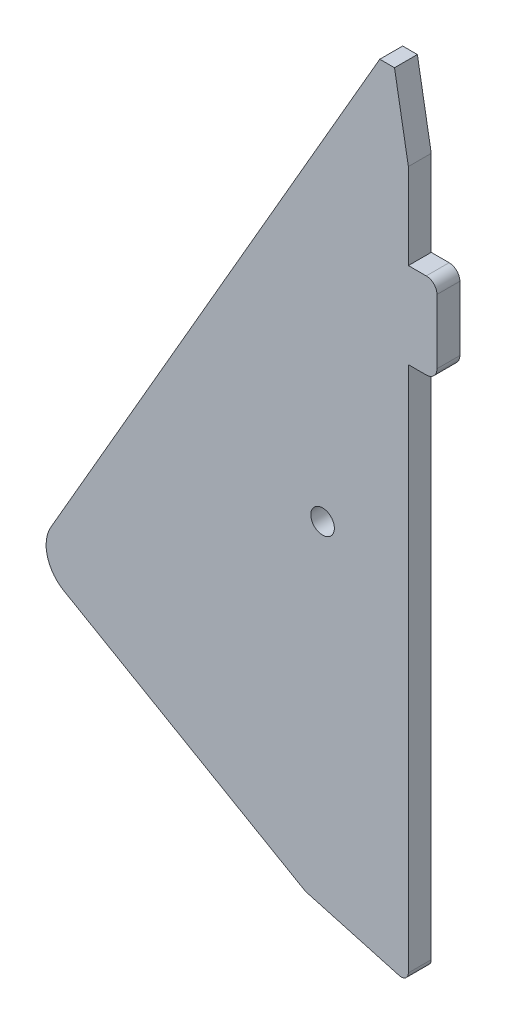
ISO-10303-21;
HEADER;
FILE_DESCRIPTION(('STEP AP214'),'2;1');
FILE_NAME('part.step','',(''),(''),'','','');
FILE_SCHEMA(('AUTOMOTIVE_DESIGN { 1 0 10303 214 1 1 1 1 }'));
ENDSEC;
DATA;
#1=APPLICATION_CONTEXT('core data for automotive mechanical design processes');
#2=APPLICATION_PROTOCOL_DEFINITION('international standard','automotive_design',2000,#1);
#3=PRODUCT_CONTEXT('',#1,'mechanical');
#4=PRODUCT('Part','Part','',(#3));
#5=PRODUCT_RELATED_PRODUCT_CATEGORY('part','',(#4));
#6=PRODUCT_DEFINITION_FORMATION('','',#4);
#7=PRODUCT_DEFINITION_CONTEXT('part definition',#1,'design');
#8=PRODUCT_DEFINITION('design','',#6,#7);
#9=PRODUCT_DEFINITION_SHAPE('','',#8);
#10=(LENGTH_UNIT() NAMED_UNIT(*) SI_UNIT(.MILLI.,.METRE.));
#11=(NAMED_UNIT(*) PLANE_ANGLE_UNIT() SI_UNIT($,.RADIAN.));
#12=(NAMED_UNIT(*) SI_UNIT($,.STERADIAN.) SOLID_ANGLE_UNIT());
#13=UNCERTAINTY_MEASURE_WITH_UNIT(LENGTH_MEASURE(1.E-05),#10,'distance_accuracy_value','');
#14=(GEOMETRIC_REPRESENTATION_CONTEXT(3) GLOBAL_UNCERTAINTY_ASSIGNED_CONTEXT((#13)) GLOBAL_UNIT_ASSIGNED_CONTEXT((#10,
#11,#12)) REPRESENTATION_CONTEXT('',''));
#15=CARTESIAN_POINT('',(0.,0.,0.));
#16=DIRECTION('',(0.,0.,1.));
#17=DIRECTION('',(1.,0.,0.));
#18=AXIS2_PLACEMENT_3D('',#15,#16,#17);
#19=CARTESIAN_POINT('',(49.9999999999627,44.0000000000083,3.2));
#20=DIRECTION('',(-1.,0.,0.));
#21=DIRECTION('',(0.,0.,1.));
#22=AXIS2_PLACEMENT_3D('',#19,#20,#21);
#23=PLANE('',#22);
#24=DIRECTION('',(0.,1.,0.));
#25=VECTOR('',#24,1.);
#26=CARTESIAN_POINT('',(49.9999999999627,44.0000000000083,3.2));
#27=LINE('',#26,#25);
#28=CARTESIAN_POINT('',(49.9999999999627,32.0000000000083,3.2));
#29=VERTEX_POINT('',#28);
#30=CARTESIAN_POINT('',(49.9999999999627,44.0000000000083,3.2));
#31=VERTEX_POINT('',#30);
#32=EDGE_CURVE('E187',#29,#31,#27,.T.);
#33=ORIENTED_EDGE('',*,*,#32,.F.);
#34=DIRECTION('',(0.,0.,1.));
#35=VECTOR('',#34,1.);
#36=CARTESIAN_POINT('',(49.9999999999627,32.0000000000083,-12.6491106406735));
#37=LINE('',#36,#35);
#38=CARTESIAN_POINT('',(49.9999999999627,32.0000000000083,0.));
#39=VERTEX_POINT('',#38);
#40=EDGE_CURVE('E186',#39,#29,#37,.T.);
#41=ORIENTED_EDGE('',*,*,#40,.F.);
#42=DIRECTION('',(0.,1.,0.));
#43=VECTOR('',#42,1.);
#44=CARTESIAN_POINT('',(49.9999999999627,44.0000000000083,0.));
#45=LINE('',#44,#43);
#46=CARTESIAN_POINT('',(49.9999999999627,44.0000000000083,0.));
#47=VERTEX_POINT('',#46);
#48=EDGE_CURVE('E169',#39,#47,#45,.T.);
#49=ORIENTED_EDGE('',*,*,#48,.T.);
#50=DIRECTION('',(0.,0.,-1.));
#51=VECTOR('',#50,1.);
#52=CARTESIAN_POINT('',(49.9999999999627,44.0000000000083,3.2));
#53=LINE('',#52,#51);
#54=EDGE_CURVE('E291',#31,#47,#53,.T.);
#55=ORIENTED_EDGE('',*,*,#54,.F.);
#56=EDGE_LOOP('',(#33,#41,#49,#55));
#57=FACE_BOUND('',#56,.T.);
#58=ADVANCED_FACE('F38',(#57),#23,.F.);
#59=CARTESIAN_POINT('',(48.9999999999626,-53.6846267095835,3.2));
#60=DIRECTION('',(0.,0.,1.));
#61=DIRECTION('',(1.,0.,0.));
#62=AXIS2_PLACEMENT_3D('',#59,#60,#61);
#63=PLANE('',#62);
#64=DIRECTION('',(0.,1.,0.));
#65=VECTOR('',#64,1.);
#66=CARTESIAN_POINT('',(53.9999999999626,32.0000000000083,3.2));
#67=LINE('',#66,#65);
#68=CARTESIAN_POINT('',(53.9999999999626,21.5000000000083,3.2));
#69=VERTEX_POINT('',#68);
#70=CARTESIAN_POINT('',(53.9999999999626,30.5000000000083,3.2));
#71=VERTEX_POINT('',#70);
#72=EDGE_CURVE('E208',#69,#71,#67,.T.);
#73=ORIENTED_EDGE('',*,*,#72,.T.);
#74=CARTESIAN_POINT('',(52.4999999999626,30.5000000000083,3.2));
#75=DIRECTION('',(0.,0.,1.));
#76=DIRECTION('',(1.,0.,0.));
#77=AXIS2_PLACEMENT_3D('',#74,#75,#76);
#78=CIRCLE('',#77,1.5);
#79=CARTESIAN_POINT('',(52.4999999999626,32.0000000000083,3.2));
#80=VERTEX_POINT('',#79);
#81=EDGE_CURVE('E312',#71,#80,#78,.T.);
#82=ORIENTED_EDGE('',*,*,#81,.T.);
#83=DIRECTION('',(-1.,0.,0.));
#84=VECTOR('',#83,1.);
#85=CARTESIAN_POINT('',(49.9999999999627,32.0000000000083,3.2));
#86=LINE('',#85,#84);
#87=EDGE_CURVE('E212',#80,#29,#86,.T.);
#88=ORIENTED_EDGE('',*,*,#87,.T.);
#89=ORIENTED_EDGE('',*,*,#32,.T.);
#90=DIRECTION('',(-0.173648177667528,0.984807753012103,0.));
#91=VECTOR('',#90,1.);
#92=CARTESIAN_POINT('',(49.9999999999627,44.0000000000083,3.2));
#93=LINE('',#92,#91);
#94=CARTESIAN_POINT('',(48.0604032121626,55.0000000000083,3.2));
#95=VERTEX_POINT('',#94);
#96=EDGE_CURVE('E237',#31,#95,#93,.T.);
#97=ORIENTED_EDGE('',*,*,#96,.T.);
#98=DIRECTION('',(-1.,0.,0.));
#99=VECTOR('',#98,1.);
#100=CARTESIAN_POINT('',(45.9999999999626,55.0000000000083,3.2));
#101=LINE('',#100,#99);
#102=CARTESIAN_POINT('',(45.9999999999626,55.0000000000083,3.2));
#103=VERTEX_POINT('',#102);
#104=EDGE_CURVE('E240',#95,#103,#101,.T.);
#105=ORIENTED_EDGE('',*,*,#104,.T.);
#106=DIRECTION('',(-0.5,-0.866025403784439,0.));
#107=VECTOR('',#106,1.);
#108=CARTESIAN_POINT('',(-4.52970386238235E-11,-24.6743371481738,3.2));
#109=LINE('',#108,#107);
#110=CARTESIAN_POINT('',(-4.52953646812304E-11,-24.6743371481738,3.2));
#111=VERTEX_POINT('',#110);
#112=EDGE_CURVE('E242',#103,#111,#109,.T.);
#113=ORIENTED_EDGE('',*,*,#112,.T.);
#114=CARTESIAN_POINT('',(4.33012701887688,-27.1743371481738,3.2));
#115=DIRECTION('',(0.,0.,1.));
#116=DIRECTION('',(1.,0.,0.));
#117=AXIS2_PLACEMENT_3D('',#114,#115,#116);
#118=CIRCLE('',#117,4.99999999999998);
#119=CARTESIAN_POINT('',(1.83012701886026,-31.5044641670864,3.2));
#120=VERTEX_POINT('',#119);
#121=EDGE_CURVE('E245',#111,#120,#118,.T.);
#122=ORIENTED_EDGE('',*,*,#121,.T.);
#123=DIRECTION('',(0.866025403784439,-0.5,0.));
#124=VECTOR('',#123,1.);
#125=CARTESIAN_POINT('',(1.83012701886026,-31.5044641670864,3.2));
#126=LINE('',#125,#124);
#127=CARTESIAN_POINT('',(35.6051177664489,-51.0044641670838,3.2));
#128=VERTEX_POINT('',#127);
#129=EDGE_CURVE('E248',#120,#128,#126,.T.);
#130=ORIENTED_EDGE('',*,*,#129,.T.);
#131=DIRECTION('',(0.963570411999862,-0.267454783315641,0.));
#132=VECTOR('',#131,1.);
#133=CARTESIAN_POINT('',(35.6051177664489,-51.0044641670838,3.2));
#134=LINE('',#133,#132);
#135=CARTESIAN_POINT('',(48.7325452166489,-54.6481971215838,3.2));
#136=VERTEX_POINT('',#135);
#137=EDGE_CURVE('E225',#128,#136,#134,.T.);
#138=ORIENTED_EDGE('',*,*,#137,.T.);
#139=CARTESIAN_POINT('',(48.9999999999626,-53.6846267095835,3.2));
#140=DIRECTION('',(0.,0.,1.));
#141=DIRECTION('',(1.,0.,0.));
#142=AXIS2_PLACEMENT_3D('',#139,#140,#141);
#143=CIRCLE('',#142,0.999999999999998);
#144=CARTESIAN_POINT('',(49.9999999999627,-53.6846267095839,3.2));
#145=VERTEX_POINT('',#144);
#146=EDGE_CURVE('E229',#136,#145,#143,.T.);
#147=ORIENTED_EDGE('',*,*,#146,.T.);
#148=CARTESIAN_POINT('',(49.9999999999627,20.0000000000083,3.2));
#149=VERTEX_POINT('',#148);
#150=EDGE_CURVE('E233',#145,#149,#27,.T.);
#151=ORIENTED_EDGE('',*,*,#150,.T.);
#152=DIRECTION('',(1.,0.,0.));
#153=VECTOR('',#152,1.);
#154=CARTESIAN_POINT('',(49.9999999999627,20.0000000000083,3.2));
#155=LINE('',#154,#153);
#156=CARTESIAN_POINT('',(52.4999999999626,20.0000000000083,3.2));
#157=VERTEX_POINT('',#156);
#158=EDGE_CURVE('E204',#149,#157,#155,.T.);
#159=ORIENTED_EDGE('',*,*,#158,.T.);
#160=CARTESIAN_POINT('',(52.4999999999626,21.5000000000083,3.2));
#161=DIRECTION('',(0.,0.,1.));
#162=DIRECTION('',(1.,0.,0.));
#163=AXIS2_PLACEMENT_3D('',#160,#161,#162);
#164=CIRCLE('',#163,1.5);
#165=EDGE_CURVE('E309',#157,#69,#164,.T.);
#166=ORIENTED_EDGE('',*,*,#165,.T.);
#167=EDGE_LOOP('',(#73,#82,#88,#89,#97,#105,#113,#122,#130,#138,#147,#151,#159,#166));
#168=FACE_BOUND('',#167,.T.);
#169=CARTESIAN_POINT('',(38.,-5.,3.2));
#170=DIRECTION('',(0.,0.,1.));
#171=DIRECTION('',(1.,0.,0.));
#172=AXIS2_PLACEMENT_3D('',#169,#170,#171);
#173=CIRCLE('',#172,1.65);
#174=CARTESIAN_POINT('',(39.65,-5.,3.2));
#175=VERTEX_POINT('',#174);
#176=EDGE_CURVE('E217',#175,#175,#173,.T.);
#177=ORIENTED_EDGE('',*,*,#176,.F.);
#178=EDGE_LOOP('',(#177));
#179=FACE_BOUND('',#178,.T.);
#180=ADVANCED_FACE('F327',(#168,#179),#63,.T.);
#181=CARTESIAN_POINT('',(48.9999999999626,-53.6846267095835,0.));
#182=DIRECTION('',(0.,0.,1.));
#183=DIRECTION('',(1.,0.,0.));
#184=AXIS2_PLACEMENT_3D('',#181,#182,#183);
#185=PLANE('',#184);
#186=DIRECTION('',(1.,0.,0.));
#187=VECTOR('',#186,1.);
#188=CARTESIAN_POINT('',(49.9999999999627,32.0000000000083,0.));
#189=LINE('',#188,#187);
#190=CARTESIAN_POINT('',(52.4999999999626,32.0000000000083,0.));
#191=VERTEX_POINT('',#190);
#192=EDGE_CURVE('E173',#39,#191,#189,.T.);
#193=ORIENTED_EDGE('',*,*,#192,.T.);
#194=CARTESIAN_POINT('',(52.4999999999626,30.5000000000083,0.));
#195=DIRECTION('',(0.,0.,1.));
#196=DIRECTION('',(1.,0.,0.));
#197=AXIS2_PLACEMENT_3D('',#194,#195,#196);
#198=CIRCLE('',#197,1.5);
#199=CARTESIAN_POINT('',(53.9999999999626,30.5000000000083,0.));
#200=VERTEX_POINT('',#199);
#201=EDGE_CURVE('E47',#191,#200,#198,.F.);
#202=ORIENTED_EDGE('',*,*,#201,.T.);
#203=DIRECTION('',(0.,-1.,0.));
#204=VECTOR('',#203,1.);
#205=CARTESIAN_POINT('',(53.9999999999626,32.0000000000083,0.));
#206=LINE('',#205,#204);
#207=CARTESIAN_POINT('',(53.9999999999626,21.5000000000083,0.));
#208=VERTEX_POINT('',#207);
#209=EDGE_CURVE('E189',#200,#208,#206,.T.);
#210=ORIENTED_EDGE('',*,*,#209,.T.);
#211=CARTESIAN_POINT('',(52.4999999999626,21.5000000000083,0.));
#212=DIRECTION('',(0.,0.,1.));
#213=DIRECTION('',(1.,0.,0.));
#214=AXIS2_PLACEMENT_3D('',#211,#212,#213);
#215=CIRCLE('',#214,1.5);
#216=CARTESIAN_POINT('',(52.4999999999626,20.0000000000083,0.));
#217=VERTEX_POINT('',#216);
#218=EDGE_CURVE('E57',#208,#217,#215,.F.);
#219=ORIENTED_EDGE('',*,*,#218,.T.);
#220=DIRECTION('',(-1.,0.,0.));
#221=VECTOR('',#220,1.);
#222=CARTESIAN_POINT('',(49.9999999999627,20.0000000000083,0.));
#223=LINE('',#222,#221);
#224=CARTESIAN_POINT('',(49.9999999999627,20.0000000000083,0.));
#225=VERTEX_POINT('',#224);
#226=EDGE_CURVE('E194',#217,#225,#223,.T.);
#227=ORIENTED_EDGE('',*,*,#226,.T.);
#228=CARTESIAN_POINT('',(49.9999999999627,-53.6846267095839,0.));
#229=VERTEX_POINT('',#228);
#230=EDGE_CURVE('E181',#229,#225,#45,.T.);
#231=ORIENTED_EDGE('',*,*,#230,.F.);
#232=CARTESIAN_POINT('',(48.9999999999626,-53.6846267095835,0.));
#233=DIRECTION('',(0.,0.,1.));
#234=DIRECTION('',(1.,0.,0.));
#235=AXIS2_PLACEMENT_3D('',#232,#233,#234);
#236=CIRCLE('',#235,0.999999999999998);
#237=CARTESIAN_POINT('',(48.7325452166489,-54.6481971215838,0.));
#238=VERTEX_POINT('',#237);
#239=EDGE_CURVE('E182',#238,#229,#236,.T.);
#240=ORIENTED_EDGE('',*,*,#239,.F.);
#241=DIRECTION('',(0.963570411999862,-0.267454783315641,0.));
#242=VECTOR('',#241,1.);
#243=CARTESIAN_POINT('',(35.6051177664489,-51.0044641670838,0.));
#244=LINE('',#243,#242);
#245=CARTESIAN_POINT('',(35.6051177664489,-51.0044641670838,0.));
#246=VERTEX_POINT('',#245);
#247=EDGE_CURVE('E221',#246,#238,#244,.T.);
#248=ORIENTED_EDGE('',*,*,#247,.F.);
#249=DIRECTION('',(0.866025403784439,-0.5,0.));
#250=VECTOR('',#249,1.);
#251=CARTESIAN_POINT('',(1.83012701886026,-31.5044641670864,0.));
#252=LINE('',#251,#250);
#253=CARTESIAN_POINT('',(1.83012701886026,-31.5044641670864,0.));
#254=VERTEX_POINT('',#253);
#255=EDGE_CURVE('E230',#254,#246,#252,.T.);
#256=ORIENTED_EDGE('',*,*,#255,.F.);
#257=CARTESIAN_POINT('',(4.33012701887688,-27.1743371481738,0.));
#258=DIRECTION('',(0.,0.,1.));
#259=DIRECTION('',(1.,0.,0.));
#260=AXIS2_PLACEMENT_3D('',#257,#258,#259);
#261=CIRCLE('',#260,4.99999999999998);
#262=CARTESIAN_POINT('',(-4.52953646812304E-11,-24.6743371481738,0.));
#263=VERTEX_POINT('',#262);
#264=EDGE_CURVE('E267',#263,#254,#261,.T.);
#265=ORIENTED_EDGE('',*,*,#264,.F.);
#266=DIRECTION('',(-0.5,-0.866025403784439,0.));
#267=VECTOR('',#266,1.);
#268=CARTESIAN_POINT('',(-4.52970386238235E-11,-24.6743371481738,0.));
#269=LINE('',#268,#267);
#270=CARTESIAN_POINT('',(45.9999999999626,55.0000000000083,0.));
#271=VERTEX_POINT('',#270);
#272=EDGE_CURVE('E264',#271,#263,#269,.T.);
#273=ORIENTED_EDGE('',*,*,#272,.F.);
#274=DIRECTION('',(-1.,0.,0.));
#275=VECTOR('',#274,1.);
#276=CARTESIAN_POINT('',(45.9999999999626,55.0000000000083,0.));
#277=LINE('',#276,#275);
#278=CARTESIAN_POINT('',(48.0604032121626,55.0000000000083,0.));
#279=VERTEX_POINT('',#278);
#280=EDGE_CURVE('E261',#279,#271,#277,.T.);
#281=ORIENTED_EDGE('',*,*,#280,.F.);
#282=DIRECTION('',(-0.173648177667528,0.984807753012103,0.));
#283=VECTOR('',#282,1.);
#284=CARTESIAN_POINT('',(49.9999999999627,44.0000000000083,0.));
#285=LINE('',#284,#283);
#286=EDGE_CURVE('E176',#47,#279,#285,.T.);
#287=ORIENTED_EDGE('',*,*,#286,.F.);
#288=ORIENTED_EDGE('',*,*,#48,.F.);
#289=EDGE_LOOP('',(#193,#202,#210,#219,#227,#231,#240,#248,#256,#265,#273,#281,#287,#288));
#290=FACE_BOUND('',#289,.T.);
#291=CARTESIAN_POINT('',(38.,-5.,0.));
#292=DIRECTION('',(0.,0.,1.));
#293=DIRECTION('',(1.,0.,0.));
#294=AXIS2_PLACEMENT_3D('',#291,#292,#293);
#295=CIRCLE('',#294,1.65);
#296=CARTESIAN_POINT('',(39.65,-5.,0.));
#297=VERTEX_POINT('',#296);
#298=EDGE_CURVE('E199',#297,#297,#295,.T.);
#299=ORIENTED_EDGE('',*,*,#298,.T.);
#300=EDGE_LOOP('',(#299));
#301=FACE_BOUND('',#300,.T.);
#302=ADVANCED_FACE('F171',(#290,#301),#185,.F.);
#303=CARTESIAN_POINT('',(35.6051177664489,-51.0044641670838,3.2));
#304=DIRECTION('',(0.267454783315641,0.963570411999862,0.));
#305=DIRECTION('',(-0.963570411999862,0.267454783315641,0.));
#306=AXIS2_PLACEMENT_3D('',#303,#304,#305);
#307=PLANE('',#306);
#308=ORIENTED_EDGE('',*,*,#247,.T.);
#309=DIRECTION('',(0.,0.,-1.));
#310=VECTOR('',#309,1.);
#311=CARTESIAN_POINT('',(48.7325452166489,-54.6481971215838,3.2));
#312=LINE('',#311,#310);
#313=EDGE_CURVE('E298',#136,#238,#312,.T.);
#314=ORIENTED_EDGE('',*,*,#313,.F.);
#315=ORIENTED_EDGE('',*,*,#137,.F.);
#316=DIRECTION('',(0.,0.,-1.));
#317=VECTOR('',#316,1.);
#318=CARTESIAN_POINT('',(35.6051177664489,-51.0044641670838,3.2));
#319=LINE('',#318,#317);
#320=EDGE_CURVE('E251',#128,#246,#319,.T.);
#321=ORIENTED_EDGE('',*,*,#320,.T.);
#322=EDGE_LOOP('',(#308,#314,#315,#321));
#323=FACE_BOUND('',#322,.T.);
#324=ADVANCED_FACE('F347',(#323),#307,.F.);
#325=CARTESIAN_POINT('',(48.9999999999626,-53.6846267095835,3.2));
#326=DIRECTION('',(0.,0.,-1.));
#327=DIRECTION('',(-1.,0.,0.));
#328=AXIS2_PLACEMENT_3D('',#325,#326,#327);
#329=CYLINDRICAL_SURFACE('',#328,0.999999999999998);
#330=ORIENTED_EDGE('',*,*,#239,.T.);
#331=DIRECTION('',(0.,0.,-1.));
#332=VECTOR('',#331,1.);
#333=CARTESIAN_POINT('',(49.9999999999627,-53.6846267095839,3.2));
#334=LINE('',#333,#332);
#335=EDGE_CURVE('E294',#145,#229,#334,.T.);
#336=ORIENTED_EDGE('',*,*,#335,.F.);
#337=ORIENTED_EDGE('',*,*,#146,.F.);
#338=ORIENTED_EDGE('',*,*,#313,.T.);
#339=EDGE_LOOP('',(#330,#336,#337,#338));
#340=FACE_BOUND('',#339,.T.);
#341=ADVANCED_FACE('F344',(#340),#329,.T.);
#342=ORIENTED_EDGE('',*,*,#230,.T.);
#343=DIRECTION('',(0.,0.,1.));
#344=VECTOR('',#343,1.);
#345=CARTESIAN_POINT('',(49.9999999999627,20.0000000000083,-12.6491106406735));
#346=LINE('',#345,#344);
#347=EDGE_CURVE('E190',#225,#149,#346,.T.);
#348=ORIENTED_EDGE('',*,*,#347,.T.);
#349=ORIENTED_EDGE('',*,*,#150,.F.);
#350=ORIENTED_EDGE('',*,*,#335,.T.);
#351=EDGE_LOOP('',(#342,#348,#349,#350));
#352=FACE_BOUND('',#351,.T.);
#353=ADVANCED_FACE('F338',(#352),#23,.F.);
#354=CARTESIAN_POINT('',(49.9999999999627,44.0000000000083,3.2));
#355=DIRECTION('',(-0.984807753012103,-0.173648177667528,0.));
#356=DIRECTION('',(0.173648177667528,-0.984807753012103,0.));
#357=AXIS2_PLACEMENT_3D('',#354,#355,#356);
#358=PLANE('',#357);
#359=ORIENTED_EDGE('',*,*,#286,.T.);
#360=DIRECTION('',(0.,0.,-1.));
#361=VECTOR('',#360,1.);
#362=CARTESIAN_POINT('',(48.0604032121626,55.0000000000083,3.2));
#363=LINE('',#362,#361);
#364=EDGE_CURVE('E287',#95,#279,#363,.T.);
#365=ORIENTED_EDGE('',*,*,#364,.F.);
#366=ORIENTED_EDGE('',*,*,#96,.F.);
#367=ORIENTED_EDGE('',*,*,#54,.T.);
#368=EDGE_LOOP('',(#359,#365,#366,#367));
#369=FACE_BOUND('',#368,.T.);
#370=ADVANCED_FACE('F369',(#369),#358,.F.);
#371=CARTESIAN_POINT('',(45.9999999999626,55.0000000000083,3.2));
#372=DIRECTION('',(0.,-1.,0.));
#373=DIRECTION('',(0.,0.,-1.));
#374=AXIS2_PLACEMENT_3D('',#371,#372,#373);
#375=PLANE('',#374);
#376=ORIENTED_EDGE('',*,*,#280,.T.);
#377=DIRECTION('',(0.,0.,-1.));
#378=VECTOR('',#377,1.);
#379=CARTESIAN_POINT('',(45.9999999999626,55.0000000000083,3.2));
#380=LINE('',#379,#378);
#381=EDGE_CURVE('E283',#103,#271,#380,.T.);
#382=ORIENTED_EDGE('',*,*,#381,.F.);
#383=ORIENTED_EDGE('',*,*,#104,.F.);
#384=ORIENTED_EDGE('',*,*,#364,.T.);
#385=EDGE_LOOP('',(#376,#382,#383,#384));
#386=FACE_BOUND('',#385,.T.);
#387=ADVANCED_FACE('F365',(#386),#375,.F.);
#388=CARTESIAN_POINT('',(-4.52970386238235E-11,-24.6743371481738,3.2));
#389=DIRECTION('',(0.866025403784439,-0.5,0.));
#390=DIRECTION('',(0.5,0.866025403784439,0.));
#391=AXIS2_PLACEMENT_3D('',#388,#389,#390);
#392=PLANE('',#391);
#393=ORIENTED_EDGE('',*,*,#272,.T.);
#394=DIRECTION('',(0.,0.,-1.));
#395=VECTOR('',#394,1.);
#396=CARTESIAN_POINT('',(-4.52953646812304E-11,-24.6743371481738,3.2));
#397=LINE('',#396,#395);
#398=EDGE_CURVE('E279',#111,#263,#397,.T.);
#399=ORIENTED_EDGE('',*,*,#398,.F.);
#400=ORIENTED_EDGE('',*,*,#112,.F.);
#401=ORIENTED_EDGE('',*,*,#381,.T.);
#402=EDGE_LOOP('',(#393,#399,#400,#401));
#403=FACE_BOUND('',#402,.T.);
#404=ADVANCED_FACE('F361',(#403),#392,.F.);
#405=CARTESIAN_POINT('',(4.33012701887688,-27.1743371481738,3.2));
#406=DIRECTION('',(0.,0.,-1.));
#407=DIRECTION('',(-1.,0.,0.));
#408=AXIS2_PLACEMENT_3D('',#405,#406,#407);
#409=CYLINDRICAL_SURFACE('',#408,4.99999999999998);
#410=ORIENTED_EDGE('',*,*,#264,.T.);
#411=DIRECTION('',(0.,0.,-1.));
#412=VECTOR('',#411,1.);
#413=CARTESIAN_POINT('',(1.83012701886026,-31.5044641670864,3.2));
#414=LINE('',#413,#412);
#415=EDGE_CURVE('E275',#120,#254,#414,.T.);
#416=ORIENTED_EDGE('',*,*,#415,.F.);
#417=ORIENTED_EDGE('',*,*,#121,.F.);
#418=ORIENTED_EDGE('',*,*,#398,.T.);
#419=EDGE_LOOP('',(#410,#416,#417,#418));
#420=FACE_BOUND('',#419,.T.);
#421=ADVANCED_FACE('F356',(#420),#409,.T.);
#422=CARTESIAN_POINT('',(1.83012701886026,-31.5044641670864,3.2));
#423=DIRECTION('',(0.5,0.866025403784439,0.));
#424=DIRECTION('',(-0.866025403784439,0.5,0.));
#425=AXIS2_PLACEMENT_3D('',#422,#423,#424);
#426=PLANE('',#425);
#427=ORIENTED_EDGE('',*,*,#255,.T.);
#428=ORIENTED_EDGE('',*,*,#320,.F.);
#429=ORIENTED_EDGE('',*,*,#129,.F.);
#430=ORIENTED_EDGE('',*,*,#415,.T.);
#431=EDGE_LOOP('',(#427,#428,#429,#430));
#432=FACE_BOUND('',#431,.T.);
#433=ADVANCED_FACE('F351',(#432),#426,.F.);
#434=CARTESIAN_POINT('',(38.,-5.,3.2));
#435=DIRECTION('',(0.,0.,-1.));
#436=DIRECTION('',(-1.,0.,0.));
#437=AXIS2_PLACEMENT_3D('',#434,#435,#436);
#438=CYLINDRICAL_SURFACE('',#437,1.65);
#439=ORIENTED_EDGE('',*,*,#176,.T.);
#440=EDGE_LOOP('',(#439));
#441=FACE_BOUND('',#440,.T.);
#442=ORIENTED_EDGE('',*,*,#298,.F.);
#443=EDGE_LOOP('',(#442));
#444=FACE_BOUND('',#443,.T.);
#445=ADVANCED_FACE('F400',(#441,#444),#438,.F.);
#446=CARTESIAN_POINT('',(49.9999999999627,32.0000000000083,-12.6491106406735));
#447=DIRECTION('',(0.,1.,0.));
#448=DIRECTION('',(0.,0.,1.));
#449=AXIS2_PLACEMENT_3D('',#446,#447,#448);
#450=PLANE('',#449);
#451=ORIENTED_EDGE('',*,*,#87,.F.);
#452=DIRECTION('',(0.,0.,1.));
#453=VECTOR('',#452,1.);
#454=CARTESIAN_POINT('',(52.4999999999626,32.0000000000083,-12.6491106406735));
#455=LINE('',#454,#453);
#456=EDGE_CURVE('E68',#80,#191,#455,.F.);
#457=ORIENTED_EDGE('',*,*,#456,.T.);
#458=ORIENTED_EDGE('',*,*,#192,.F.);
#459=ORIENTED_EDGE('',*,*,#40,.T.);
#460=EDGE_LOOP('',(#451,#457,#458,#459));
#461=FACE_BOUND('',#460,.T.);
#462=ADVANCED_FACE('F192',(#461),#450,.T.);
#463=CARTESIAN_POINT('',(53.9999999999626,32.0000000000083,-12.6491106406735));
#464=DIRECTION('',(1.,0.,0.));
#465=DIRECTION('',(0.,1.,0.));
#466=AXIS2_PLACEMENT_3D('',#463,#464,#465);
#467=PLANE('',#466);
#468=ORIENTED_EDGE('',*,*,#209,.F.);
#469=DIRECTION('',(0.,0.,1.));
#470=VECTOR('',#469,1.);
#471=CARTESIAN_POINT('',(53.9999999999626,30.5000000000083,-12.6491106406735));
#472=LINE('',#471,#470);
#473=EDGE_CURVE('E305',#200,#71,#472,.T.);
#474=ORIENTED_EDGE('',*,*,#473,.T.);
#475=ORIENTED_EDGE('',*,*,#72,.F.);
#476=DIRECTION('',(0.,0.,1.));
#477=VECTOR('',#476,1.);
#478=CARTESIAN_POINT('',(53.9999999999626,21.5000000000083,-12.6491106406735));
#479=LINE('',#478,#477);
#480=EDGE_CURVE('E302',#69,#208,#479,.F.);
#481=ORIENTED_EDGE('',*,*,#480,.T.);
#482=EDGE_LOOP('',(#468,#474,#475,#481));
#483=FACE_BOUND('',#482,.T.);
#484=ADVANCED_FACE('F322',(#483),#467,.T.);
#485=CARTESIAN_POINT('',(49.9999999999627,20.0000000000083,-12.6491106406735));
#486=DIRECTION('',(0.,-1.,0.));
#487=DIRECTION('',(0.,0.,-1.));
#488=AXIS2_PLACEMENT_3D('',#485,#486,#487);
#489=PLANE('',#488);
#490=ORIENTED_EDGE('',*,*,#226,.F.);
#491=DIRECTION('',(0.,0.,1.));
#492=VECTOR('',#491,1.);
#493=CARTESIAN_POINT('',(52.4999999999626,20.0000000000083,-12.6491106406735));
#494=LINE('',#493,#492);
#495=EDGE_CURVE('E11',#217,#157,#494,.T.);
#496=ORIENTED_EDGE('',*,*,#495,.T.);
#497=ORIENTED_EDGE('',*,*,#158,.F.);
#498=ORIENTED_EDGE('',*,*,#347,.F.);
#499=EDGE_LOOP('',(#490,#496,#497,#498));
#500=FACE_BOUND('',#499,.T.);
#501=ADVANCED_FACE('F333',(#500),#489,.T.);
#502=CARTESIAN_POINT('',(52.4999999999626,30.5000000000083,-12.6491106406735));
#503=DIRECTION('',(0.,0.,1.));
#504=DIRECTION('',(1.,0.,0.));
#505=AXIS2_PLACEMENT_3D('',#502,#503,#504);
#506=CYLINDRICAL_SURFACE('',#505,1.5);
#507=ORIENTED_EDGE('',*,*,#201,.F.);
#508=ORIENTED_EDGE('',*,*,#456,.F.);
#509=ORIENTED_EDGE('',*,*,#81,.F.);
#510=ORIENTED_EDGE('',*,*,#473,.F.);
#511=EDGE_LOOP('',(#507,#508,#509,#510));
#512=FACE_BOUND('',#511,.T.);
#513=ADVANCED_FACE('F325',(#512),#506,.T.);
#514=CARTESIAN_POINT('',(52.4999999999626,21.5000000000083,-12.6491106406735));
#515=DIRECTION('',(0.,0.,1.));
#516=DIRECTION('',(1.,0.,0.));
#517=AXIS2_PLACEMENT_3D('',#514,#515,#516);
#518=CYLINDRICAL_SURFACE('',#517,1.5);
#519=ORIENTED_EDGE('',*,*,#218,.F.);
#520=ORIENTED_EDGE('',*,*,#480,.F.);
#521=ORIENTED_EDGE('',*,*,#165,.F.);
#522=ORIENTED_EDGE('',*,*,#495,.F.);
#523=EDGE_LOOP('',(#519,#520,#521,#522));
#524=FACE_BOUND('',#523,.T.);
#525=ADVANCED_FACE('F40',(#524),#518,.T.);
#526=CLOSED_SHELL('',(#58,#180,#302,#324,#341,#353,#370,#387,#404,#421,#433,#445,#462,#484,#501,
#513,#525));
#527=MANIFOLD_SOLID_BREP('B2',#526);
#528=ADVANCED_BREP_SHAPE_REPRESENTATION('',(#18,#527),#14);
#529=SHAPE_DEFINITION_REPRESENTATION(#9,#528);
ENDSEC;
END-ISO-10303-21;
